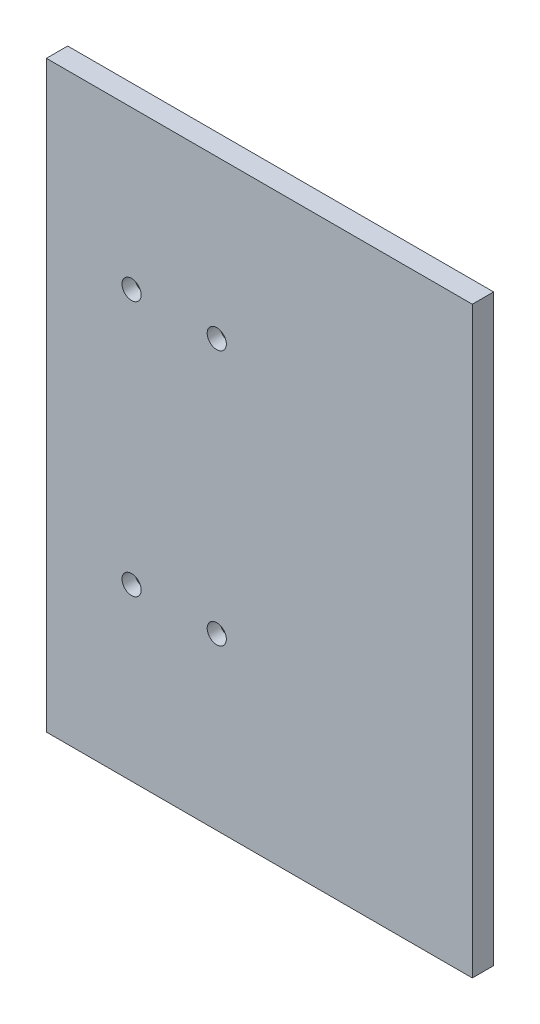
ISO-10303-21;
HEADER;
FILE_DESCRIPTION(('STEP AP214'),'2;1');
FILE_NAME('part.step','',(''),(''),'','','');
FILE_SCHEMA(('AUTOMOTIVE_DESIGN { 1 0 10303 214 1 1 1 1 }'));
ENDSEC;
DATA;
#1=APPLICATION_CONTEXT('core data for automotive mechanical design processes');
#2=APPLICATION_PROTOCOL_DEFINITION('international standard','automotive_design',2000,#1);
#3=PRODUCT_CONTEXT('',#1,'mechanical');
#4=PRODUCT('Part','Part','',(#3));
#5=PRODUCT_RELATED_PRODUCT_CATEGORY('part','',(#4));
#6=PRODUCT_DEFINITION_FORMATION('','',#4);
#7=PRODUCT_DEFINITION_CONTEXT('part definition',#1,'design');
#8=PRODUCT_DEFINITION('design','',#6,#7);
#9=PRODUCT_DEFINITION_SHAPE('','',#8);
#10=(LENGTH_UNIT() NAMED_UNIT(*) SI_UNIT(.MILLI.,.METRE.));
#11=(NAMED_UNIT(*) PLANE_ANGLE_UNIT() SI_UNIT($,.RADIAN.));
#12=(NAMED_UNIT(*) SI_UNIT($,.STERADIAN.) SOLID_ANGLE_UNIT());
#13=UNCERTAINTY_MEASURE_WITH_UNIT(LENGTH_MEASURE(1.E-05),#10,'distance_accuracy_value','');
#14=(GEOMETRIC_REPRESENTATION_CONTEXT(3) GLOBAL_UNCERTAINTY_ASSIGNED_CONTEXT((#13)) GLOBAL_UNIT_ASSIGNED_CONTEXT((#10,
#11,#12)) REPRESENTATION_CONTEXT('',''));
#15=CARTESIAN_POINT('',(0.,0.,0.));
#16=DIRECTION('',(0.,0.,1.));
#17=DIRECTION('',(1.,0.,0.));
#18=AXIS2_PLACEMENT_3D('',#15,#16,#17);
#19=CARTESIAN_POINT('',(-63.5,173.99,6.35));
#20=DIRECTION('',(1.,0.,0.));
#21=DIRECTION('',(0.,0.,-1.));
#22=AXIS2_PLACEMENT_3D('',#19,#20,#21);
#23=PLANE('',#22);
#24=DIRECTION('',(0.,-1.,0.));
#25=VECTOR('',#24,1.);
#26=CARTESIAN_POINT('',(-63.5,173.99,0.));
#27=LINE('',#26,#25);
#28=CARTESIAN_POINT('',(-63.5,173.99,0.));
#29=VERTEX_POINT('',#28);
#30=CARTESIAN_POINT('',(-63.5,0.,0.));
#31=VERTEX_POINT('',#30);
#32=EDGE_CURVE('E95',#29,#31,#27,.T.);
#33=ORIENTED_EDGE('',*,*,#32,.T.);
#34=DIRECTION('',(0.,0.,-1.));
#35=VECTOR('',#34,1.);
#36=CARTESIAN_POINT('',(-63.5,0.,6.35));
#37=LINE('',#36,#35);
#38=CARTESIAN_POINT('',(-63.5,0.,6.35));
#39=VERTEX_POINT('',#38);
#40=EDGE_CURVE('E48',#39,#31,#37,.T.);
#41=ORIENTED_EDGE('',*,*,#40,.F.);
#42=DIRECTION('',(0.,-1.,0.));
#43=VECTOR('',#42,1.);
#44=CARTESIAN_POINT('',(-63.5,173.99,6.35));
#45=LINE('',#44,#43);
#46=CARTESIAN_POINT('',(-63.5,173.99,6.35));
#47=VERTEX_POINT('',#46);
#48=EDGE_CURVE('E87',#47,#39,#45,.T.);
#49=ORIENTED_EDGE('',*,*,#48,.F.);
#50=DIRECTION('',(0.,0.,-1.));
#51=VECTOR('',#50,1.);
#52=CARTESIAN_POINT('',(-63.5,173.99,6.35));
#53=LINE('',#52,#51);
#54=EDGE_CURVE('E11',#47,#29,#53,.T.);
#55=ORIENTED_EDGE('',*,*,#54,.T.);
#56=EDGE_LOOP('',(#33,#41,#49,#55));
#57=FACE_BOUND('',#56,.T.);
#58=ADVANCED_FACE('F39',(#57),#23,.F.);
#59=CARTESIAN_POINT('',(63.5,0.,6.35));
#60=DIRECTION('',(0.,1.,0.));
#61=DIRECTION('',(-1.,0.,0.));
#62=AXIS2_PLACEMENT_3D('',#59,#60,#61);
#63=PLANE('',#62);
#64=DIRECTION('',(1.,0.,0.));
#65=VECTOR('',#64,1.);
#66=CARTESIAN_POINT('',(63.5,0.,0.));
#67=LINE('',#66,#65);
#68=CARTESIAN_POINT('',(63.5,0.,0.));
#69=VERTEX_POINT('',#68);
#70=EDGE_CURVE('E74',#31,#69,#67,.T.);
#71=ORIENTED_EDGE('',*,*,#70,.T.);
#72=DIRECTION('',(0.,0.,-1.));
#73=VECTOR('',#72,1.);
#74=CARTESIAN_POINT('',(63.5,0.,6.35));
#75=LINE('',#74,#73);
#76=CARTESIAN_POINT('',(63.5,0.,6.35));
#77=VERTEX_POINT('',#76);
#78=EDGE_CURVE('E97',#77,#69,#75,.T.);
#79=ORIENTED_EDGE('',*,*,#78,.F.);
#80=DIRECTION('',(1.,0.,0.));
#81=VECTOR('',#80,1.);
#82=CARTESIAN_POINT('',(63.5,0.,6.35));
#83=LINE('',#82,#81);
#84=EDGE_CURVE('E91',#39,#77,#83,.T.);
#85=ORIENTED_EDGE('',*,*,#84,.F.);
#86=ORIENTED_EDGE('',*,*,#40,.T.);
#87=EDGE_LOOP('',(#71,#79,#85,#86));
#88=FACE_BOUND('',#87,.T.);
#89=ADVANCED_FACE('F98',(#88),#63,.F.);
#90=CARTESIAN_POINT('',(63.5,173.99,6.35));
#91=DIRECTION('',(-1.,0.,0.));
#92=DIRECTION('',(0.,0.,1.));
#93=AXIS2_PLACEMENT_3D('',#90,#91,#92);
#94=PLANE('',#93);
#95=DIRECTION('',(0.,1.,0.));
#96=VECTOR('',#95,1.);
#97=CARTESIAN_POINT('',(63.5,173.99,0.));
#98=LINE('',#97,#96);
#99=CARTESIAN_POINT('',(63.5,173.99,0.));
#100=VERTEX_POINT('',#99);
#101=EDGE_CURVE('E81',#69,#100,#98,.T.);
#102=ORIENTED_EDGE('',*,*,#101,.T.);
#103=DIRECTION('',(0.,0.,-1.));
#104=VECTOR('',#103,1.);
#105=CARTESIAN_POINT('',(63.5,173.99,6.35));
#106=LINE('',#105,#104);
#107=CARTESIAN_POINT('',(63.5,173.99,6.35));
#108=VERTEX_POINT('',#107);
#109=EDGE_CURVE('E104',#108,#100,#106,.T.);
#110=ORIENTED_EDGE('',*,*,#109,.F.);
#111=DIRECTION('',(0.,1.,0.));
#112=VECTOR('',#111,1.);
#113=CARTESIAN_POINT('',(63.5,173.99,6.35));
#114=LINE('',#113,#112);
#115=EDGE_CURVE('E101',#77,#108,#114,.T.);
#116=ORIENTED_EDGE('',*,*,#115,.F.);
#117=ORIENTED_EDGE('',*,*,#78,.T.);
#118=EDGE_LOOP('',(#102,#110,#116,#117));
#119=FACE_BOUND('',#118,.T.);
#120=ADVANCED_FACE('F121',(#119),#94,.F.);
#121=CARTESIAN_POINT('',(0.,173.99,6.35));
#122=DIRECTION('',(0.,-1.,0.));
#123=DIRECTION('',(0.,0.,-1.));
#124=AXIS2_PLACEMENT_3D('',#121,#122,#123);
#125=PLANE('',#124);
#126=DIRECTION('',(-1.,0.,0.));
#127=VECTOR('',#126,1.);
#128=CARTESIAN_POINT('',(0.,173.99,0.));
#129=LINE('',#128,#127);
#130=EDGE_CURVE('E115',#100,#29,#129,.T.);
#131=ORIENTED_EDGE('',*,*,#130,.T.);
#132=ORIENTED_EDGE('',*,*,#54,.F.);
#133=DIRECTION('',(-1.,0.,0.));
#134=VECTOR('',#133,1.);
#135=CARTESIAN_POINT('',(0.,173.99,6.35));
#136=LINE('',#135,#134);
#137=EDGE_CURVE('E56',#108,#47,#136,.T.);
#138=ORIENTED_EDGE('',*,*,#137,.F.);
#139=ORIENTED_EDGE('',*,*,#109,.T.);
#140=EDGE_LOOP('',(#131,#132,#138,#139));
#141=FACE_BOUND('',#140,.T.);
#142=ADVANCED_FACE('F125',(#141),#125,.F.);
#143=CARTESIAN_POINT('',(0.,0.,6.35));
#144=DIRECTION('',(0.,0.,1.));
#145=DIRECTION('',(1.,0.,0.));
#146=AXIS2_PLACEMENT_3D('',#143,#144,#145);
#147=PLANE('',#146);
#148=CARTESIAN_POINT('',(-38.1,50.8,6.35));
#149=DIRECTION('',(0.,0.,1.));
#150=DIRECTION('',(1.,0.,0.));
#151=AXIS2_PLACEMENT_3D('',#148,#149,#150);
#152=CIRCLE('',#151,2.8575);
#153=CARTESIAN_POINT('',(-35.2425,50.8,6.35));
#154=VERTEX_POINT('',#153);
#155=EDGE_CURVE('E368',#154,#154,#152,.T.);
#156=ORIENTED_EDGE('',*,*,#155,.F.);
#157=EDGE_LOOP('',(#156));
#158=FACE_BOUND('',#157,.T.);
#159=CARTESIAN_POINT('',(-12.7,50.8,6.35));
#160=DIRECTION('',(0.,0.,1.));
#161=DIRECTION('',(1.,0.,0.));
#162=AXIS2_PLACEMENT_3D('',#159,#160,#161);
#163=CIRCLE('',#162,2.8575);
#164=CARTESIAN_POINT('',(-9.8425,50.8,6.35));
#165=VERTEX_POINT('',#164);
#166=EDGE_CURVE('E360',#165,#165,#163,.T.);
#167=ORIENTED_EDGE('',*,*,#166,.F.);
#168=EDGE_LOOP('',(#167));
#169=FACE_BOUND('',#168,.T.);
#170=CARTESIAN_POINT('',(-12.7,127.,6.35));
#171=DIRECTION('',(0.,0.,1.));
#172=DIRECTION('',(1.,0.,0.));
#173=AXIS2_PLACEMENT_3D('',#170,#171,#172);
#174=CIRCLE('',#173,2.8575);
#175=CARTESIAN_POINT('',(-9.8425,127.,6.35));
#176=VERTEX_POINT('',#175);
#177=EDGE_CURVE('E351',#176,#176,#174,.T.);
#178=ORIENTED_EDGE('',*,*,#177,.F.);
#179=EDGE_LOOP('',(#178));
#180=FACE_BOUND('',#179,.T.);
#181=CARTESIAN_POINT('',(-38.1,127.,6.35));
#182=DIRECTION('',(0.,0.,1.));
#183=DIRECTION('',(1.,0.,0.));
#184=AXIS2_PLACEMENT_3D('',#181,#182,#183);
#185=CIRCLE('',#184,2.8575);
#186=CARTESIAN_POINT('',(-35.2425,127.,6.35));
#187=VERTEX_POINT('',#186);
#188=EDGE_CURVE('E355',#187,#187,#185,.T.);
#189=ORIENTED_EDGE('',*,*,#188,.F.);
#190=EDGE_LOOP('',(#189));
#191=FACE_BOUND('',#190,.T.);
#192=ORIENTED_EDGE('',*,*,#137,.T.);
#193=ORIENTED_EDGE('',*,*,#48,.T.);
#194=ORIENTED_EDGE('',*,*,#84,.T.);
#195=ORIENTED_EDGE('',*,*,#115,.T.);
#196=EDGE_LOOP('',(#192,#193,#194,#195));
#197=FACE_BOUND('',#196,.T.);
#198=ADVANCED_FACE('F89',(#158,#169,#180,#191,#197),#147,.T.);
#199=CARTESIAN_POINT('',(0.,0.,0.));
#200=DIRECTION('',(0.,0.,1.));
#201=DIRECTION('',(1.,0.,0.));
#202=AXIS2_PLACEMENT_3D('',#199,#200,#201);
#203=PLANE('',#202);
#204=CARTESIAN_POINT('',(43.0645431175458,51.4702652625299,0.));
#205=DIRECTION('',(0.,0.,-1.));
#206=DIRECTION('',(-1.,0.,0.));
#207=AXIS2_PLACEMENT_3D('',#204,#205,#206);
#208=CIRCLE('',#207,2.8575);
#209=CARTESIAN_POINT('',(40.2070431175458,51.4702652625299,0.));
#210=VERTEX_POINT('',#209);
#211=EDGE_CURVE('E333',#210,#210,#208,.T.);
#212=ORIENTED_EDGE('',*,*,#211,.F.);
#213=EDGE_LOOP('',(#212));
#214=FACE_BOUND('',#213,.T.);
#215=CARTESIAN_POINT('',(3.69454311754585,51.4702652625299,0.));
#216=DIRECTION('',(0.,0.,-1.));
#217=DIRECTION('',(-1.,0.,0.));
#218=AXIS2_PLACEMENT_3D('',#215,#216,#217);
#219=CIRCLE('',#218,2.8575);
#220=CARTESIAN_POINT('',(0.837043117545849,51.4702652625299,0.));
#221=VERTEX_POINT('',#220);
#222=EDGE_CURVE('E388',#221,#221,#219,.T.);
#223=ORIENTED_EDGE('',*,*,#222,.F.);
#224=EDGE_LOOP('',(#223));
#225=FACE_BOUND('',#224,.T.);
#226=CARTESIAN_POINT('',(3.69454311754585,133.51026526253,0.));
#227=DIRECTION('',(0.,0.,-1.));
#228=DIRECTION('',(-1.,0.,0.));
#229=AXIS2_PLACEMENT_3D('',#226,#227,#228);
#230=CIRCLE('',#229,2.8575);
#231=CARTESIAN_POINT('',(0.837043117545849,133.51026526253,0.));
#232=VERTEX_POINT('',#231);
#233=EDGE_CURVE('E350',#232,#232,#230,.T.);
#234=ORIENTED_EDGE('',*,*,#233,.F.);
#235=EDGE_LOOP('',(#234));
#236=FACE_BOUND('',#235,.T.);
#237=CARTESIAN_POINT('',(43.0645431175458,133.51026526253,0.));
#238=DIRECTION('',(0.,0.,-1.));
#239=DIRECTION('',(-1.,0.,0.));
#240=AXIS2_PLACEMENT_3D('',#237,#238,#239);
#241=CIRCLE('',#240,2.8575);
#242=CARTESIAN_POINT('',(40.2070431175458,133.51026526253,0.));
#243=VERTEX_POINT('',#242);
#244=EDGE_CURVE('E346',#243,#243,#241,.T.);
#245=ORIENTED_EDGE('',*,*,#244,.F.);
#246=EDGE_LOOP('',(#245));
#247=FACE_BOUND('',#246,.T.);
#248=ORIENTED_EDGE('',*,*,#32,.F.);
#249=ORIENTED_EDGE('',*,*,#130,.F.);
#250=ORIENTED_EDGE('',*,*,#101,.F.);
#251=ORIENTED_EDGE('',*,*,#70,.F.);
#252=EDGE_LOOP('',(#248,#249,#250,#251));
#253=FACE_BOUND('',#252,.T.);
#254=ADVANCED_FACE('F124',(#214,#225,#236,#247,#253),#203,.F.);
#255=CARTESIAN_POINT('',(-38.1,127.,2.54));
#256=DIRECTION('',(0.,0.,1.));
#257=DIRECTION('',(1.,0.,0.));
#258=AXIS2_PLACEMENT_3D('',#255,#256,#257);
#259=CYLINDRICAL_SURFACE('',#258,2.8575);
#260=CARTESIAN_POINT('',(-38.1,127.,2.54));
#261=DIRECTION('',(0.,0.,1.));
#262=DIRECTION('',(1.,0.,0.));
#263=AXIS2_PLACEMENT_3D('',#260,#261,#262);
#264=CIRCLE('',#263,2.8575);
#265=CARTESIAN_POINT('',(-35.2425,127.,2.54));
#266=VERTEX_POINT('',#265);
#267=EDGE_CURVE('E110',#266,#266,#264,.T.);
#268=ORIENTED_EDGE('',*,*,#267,.F.);
#269=EDGE_LOOP('',(#268));
#270=FACE_BOUND('',#269,.T.);
#271=ORIENTED_EDGE('',*,*,#188,.T.);
#272=EDGE_LOOP('',(#271));
#273=FACE_BOUND('',#272,.T.);
#274=ADVANCED_FACE('F164',(#270,#273),#259,.F.);
#275=CARTESIAN_POINT('',(-38.1,127.,2.54));
#276=DIRECTION('',(0.,0.,1.));
#277=DIRECTION('',(1.,0.,0.));
#278=AXIS2_PLACEMENT_3D('',#275,#276,#277);
#279=PLANE('',#278);
#280=ORIENTED_EDGE('',*,*,#267,.T.);
#281=EDGE_LOOP('',(#280));
#282=FACE_BOUND('',#281,.T.);
#283=ADVANCED_FACE('F169',(#282),#279,.T.);
#284=CARTESIAN_POINT('',(-12.7,127.,2.54));
#285=DIRECTION('',(0.,0.,1.));
#286=DIRECTION('',(1.,0.,0.));
#287=AXIS2_PLACEMENT_3D('',#284,#285,#286);
#288=CYLINDRICAL_SURFACE('',#287,2.8575);
#289=CARTESIAN_POINT('',(-12.7,127.,2.54));
#290=DIRECTION('',(0.,0.,1.));
#291=DIRECTION('',(1.,0.,0.));
#292=AXIS2_PLACEMENT_3D('',#289,#290,#291);
#293=CIRCLE('',#292,2.8575);
#294=CARTESIAN_POINT('',(-9.8425,127.,2.54));
#295=VERTEX_POINT('',#294);
#296=EDGE_CURVE('E356',#295,#295,#293,.T.);
#297=ORIENTED_EDGE('',*,*,#296,.F.);
#298=EDGE_LOOP('',(#297));
#299=FACE_BOUND('',#298,.T.);
#300=ORIENTED_EDGE('',*,*,#177,.T.);
#301=EDGE_LOOP('',(#300));
#302=FACE_BOUND('',#301,.T.);
#303=ADVANCED_FACE('F179',(#299,#302),#288,.F.);
#304=CARTESIAN_POINT('',(-12.7,127.,2.54));
#305=DIRECTION('',(0.,0.,1.));
#306=DIRECTION('',(1.,0.,0.));
#307=AXIS2_PLACEMENT_3D('',#304,#305,#306);
#308=PLANE('',#307);
#309=ORIENTED_EDGE('',*,*,#296,.T.);
#310=EDGE_LOOP('',(#309));
#311=FACE_BOUND('',#310,.T.);
#312=ADVANCED_FACE('F189',(#311),#308,.T.);
#313=CARTESIAN_POINT('',(-12.7,50.8,2.54));
#314=DIRECTION('',(0.,0.,1.));
#315=DIRECTION('',(1.,0.,0.));
#316=AXIS2_PLACEMENT_3D('',#313,#314,#315);
#317=CYLINDRICAL_SURFACE('',#316,2.8575);
#318=CARTESIAN_POINT('',(-12.7,50.8,2.54));
#319=DIRECTION('',(0.,0.,1.));
#320=DIRECTION('',(1.,0.,0.));
#321=AXIS2_PLACEMENT_3D('',#318,#319,#320);
#322=CIRCLE('',#321,2.8575);
#323=CARTESIAN_POINT('',(-9.8425,50.8,2.54));
#324=VERTEX_POINT('',#323);
#325=EDGE_CURVE('E364',#324,#324,#322,.T.);
#326=ORIENTED_EDGE('',*,*,#325,.F.);
#327=EDGE_LOOP('',(#326));
#328=FACE_BOUND('',#327,.T.);
#329=ORIENTED_EDGE('',*,*,#166,.T.);
#330=EDGE_LOOP('',(#329));
#331=FACE_BOUND('',#330,.T.);
#332=ADVANCED_FACE('F199',(#328,#331),#317,.F.);
#333=CARTESIAN_POINT('',(-12.7,50.8,2.54));
#334=DIRECTION('',(0.,0.,1.));
#335=DIRECTION('',(1.,0.,0.));
#336=AXIS2_PLACEMENT_3D('',#333,#334,#335);
#337=PLANE('',#336);
#338=ORIENTED_EDGE('',*,*,#325,.T.);
#339=EDGE_LOOP('',(#338));
#340=FACE_BOUND('',#339,.T.);
#341=ADVANCED_FACE('F209',(#340),#337,.T.);
#342=CARTESIAN_POINT('',(-38.1,50.8,2.54));
#343=DIRECTION('',(0.,0.,1.));
#344=DIRECTION('',(1.,0.,0.));
#345=AXIS2_PLACEMENT_3D('',#342,#343,#344);
#346=CYLINDRICAL_SURFACE('',#345,2.8575);
#347=CARTESIAN_POINT('',(-38.1,50.8,2.54));
#348=DIRECTION('',(0.,0.,1.));
#349=DIRECTION('',(1.,0.,0.));
#350=AXIS2_PLACEMENT_3D('',#347,#348,#349);
#351=CIRCLE('',#350,2.8575);
#352=CARTESIAN_POINT('',(-35.2425,50.8,2.54));
#353=VERTEX_POINT('',#352);
#354=EDGE_CURVE('E345',#353,#353,#351,.T.);
#355=ORIENTED_EDGE('',*,*,#354,.F.);
#356=EDGE_LOOP('',(#355));
#357=FACE_BOUND('',#356,.T.);
#358=ORIENTED_EDGE('',*,*,#155,.T.);
#359=EDGE_LOOP('',(#358));
#360=FACE_BOUND('',#359,.T.);
#361=ADVANCED_FACE('F219',(#357,#360),#346,.F.);
#362=CARTESIAN_POINT('',(-38.1,50.8,2.54));
#363=DIRECTION('',(0.,0.,1.));
#364=DIRECTION('',(1.,0.,0.));
#365=AXIS2_PLACEMENT_3D('',#362,#363,#364);
#366=PLANE('',#365);
#367=ORIENTED_EDGE('',*,*,#354,.T.);
#368=EDGE_LOOP('',(#367));
#369=FACE_BOUND('',#368,.T.);
#370=ADVANCED_FACE('F229',(#369),#366,.T.);
#371=CARTESIAN_POINT('',(43.0645431175458,133.51026526253,3.81));
#372=DIRECTION('',(0.,0.,-1.));
#373=DIRECTION('',(-1.,0.,0.));
#374=AXIS2_PLACEMENT_3D('',#371,#372,#373);
#375=CYLINDRICAL_SURFACE('',#374,2.8575);
#376=CARTESIAN_POINT('',(43.0645431175458,133.51026526253,3.81));
#377=DIRECTION('',(0.,0.,-1.));
#378=DIRECTION('',(-1.,0.,0.));
#379=AXIS2_PLACEMENT_3D('',#376,#377,#378);
#380=CIRCLE('',#379,2.8575);
#381=CARTESIAN_POINT('',(40.2070431175458,133.51026526253,3.81));
#382=VERTEX_POINT('',#381);
#383=EDGE_CURVE('E341',#382,#382,#380,.T.);
#384=ORIENTED_EDGE('',*,*,#383,.F.);
#385=EDGE_LOOP('',(#384));
#386=FACE_BOUND('',#385,.T.);
#387=ORIENTED_EDGE('',*,*,#244,.T.);
#388=EDGE_LOOP('',(#387));
#389=FACE_BOUND('',#388,.T.);
#390=ADVANCED_FACE('F239',(#386,#389),#375,.F.);
#391=CARTESIAN_POINT('',(43.0645431175458,133.51026526253,3.81));
#392=DIRECTION('',(0.,0.,-1.));
#393=DIRECTION('',(-1.,0.,0.));
#394=AXIS2_PLACEMENT_3D('',#391,#392,#393);
#395=PLANE('',#394);
#396=ORIENTED_EDGE('',*,*,#383,.T.);
#397=EDGE_LOOP('',(#396));
#398=FACE_BOUND('',#397,.T.);
#399=ADVANCED_FACE('F255',(#398),#395,.T.);
#400=CARTESIAN_POINT('',(3.69454311754585,133.51026526253,3.81));
#401=DIRECTION('',(0.,0.,-1.));
#402=DIRECTION('',(-1.,0.,0.));
#403=AXIS2_PLACEMENT_3D('',#400,#401,#402);
#404=CYLINDRICAL_SURFACE('',#403,2.8575);
#405=CARTESIAN_POINT('',(3.69454311754585,133.51026526253,3.81));
#406=DIRECTION('',(0.,0.,-1.));
#407=DIRECTION('',(-1.,0.,0.));
#408=AXIS2_PLACEMENT_3D('',#405,#406,#407);
#409=CIRCLE('',#408,2.8575);
#410=CARTESIAN_POINT('',(0.837043117545849,133.51026526253,3.81));
#411=VERTEX_POINT('',#410);
#412=EDGE_CURVE('E384',#411,#411,#409,.T.);
#413=ORIENTED_EDGE('',*,*,#412,.F.);
#414=EDGE_LOOP('',(#413));
#415=FACE_BOUND('',#414,.T.);
#416=ORIENTED_EDGE('',*,*,#233,.T.);
#417=EDGE_LOOP('',(#416));
#418=FACE_BOUND('',#417,.T.);
#419=ADVANCED_FACE('F265',(#415,#418),#404,.F.);
#420=CARTESIAN_POINT('',(3.69454311754585,133.51026526253,3.81));
#421=DIRECTION('',(0.,0.,-1.));
#422=DIRECTION('',(-1.,0.,0.));
#423=AXIS2_PLACEMENT_3D('',#420,#421,#422);
#424=PLANE('',#423);
#425=ORIENTED_EDGE('',*,*,#412,.T.);
#426=EDGE_LOOP('',(#425));
#427=FACE_BOUND('',#426,.T.);
#428=ADVANCED_FACE('F275',(#427),#424,.T.);
#429=CARTESIAN_POINT('',(3.69454311754585,51.4702652625299,3.81));
#430=DIRECTION('',(0.,0.,-1.));
#431=DIRECTION('',(-1.,0.,0.));
#432=AXIS2_PLACEMENT_3D('',#429,#430,#431);
#433=CYLINDRICAL_SURFACE('',#432,2.8575);
#434=CARTESIAN_POINT('',(3.69454311754585,51.4702652625299,3.81));
#435=DIRECTION('',(0.,0.,-1.));
#436=DIRECTION('',(-1.,0.,0.));
#437=AXIS2_PLACEMENT_3D('',#434,#435,#436);
#438=CIRCLE('',#437,2.8575);
#439=CARTESIAN_POINT('',(0.837043117545849,51.4702652625299,3.81));
#440=VERTEX_POINT('',#439);
#441=EDGE_CURVE('E337',#440,#440,#438,.T.);
#442=ORIENTED_EDGE('',*,*,#441,.F.);
#443=EDGE_LOOP('',(#442));
#444=FACE_BOUND('',#443,.T.);
#445=ORIENTED_EDGE('',*,*,#222,.T.);
#446=EDGE_LOOP('',(#445));
#447=FACE_BOUND('',#446,.T.);
#448=ADVANCED_FACE('F285',(#444,#447),#433,.F.);
#449=CARTESIAN_POINT('',(3.69454311754585,51.4702652625299,3.81));
#450=DIRECTION('',(0.,0.,-1.));
#451=DIRECTION('',(-1.,0.,0.));
#452=AXIS2_PLACEMENT_3D('',#449,#450,#451);
#453=PLANE('',#452);
#454=ORIENTED_EDGE('',*,*,#441,.T.);
#455=EDGE_LOOP('',(#454));
#456=FACE_BOUND('',#455,.T.);
#457=ADVANCED_FACE('F295',(#456),#453,.T.);
#458=CARTESIAN_POINT('',(43.0645431175458,51.4702652625299,3.81));
#459=DIRECTION('',(0.,0.,-1.));
#460=DIRECTION('',(-1.,0.,0.));
#461=AXIS2_PLACEMENT_3D('',#458,#459,#460);
#462=CYLINDRICAL_SURFACE('',#461,2.8575);
#463=CARTESIAN_POINT('',(43.0645431175458,51.4702652625299,3.81));
#464=DIRECTION('',(0.,0.,-1.));
#465=DIRECTION('',(-1.,0.,0.));
#466=AXIS2_PLACEMENT_3D('',#463,#464,#465);
#467=CIRCLE('',#466,2.8575);
#468=CARTESIAN_POINT('',(40.2070431175458,51.4702652625299,3.81));
#469=VERTEX_POINT('',#468);
#470=EDGE_CURVE('E331',#469,#469,#467,.T.);
#471=ORIENTED_EDGE('',*,*,#470,.F.);
#472=EDGE_LOOP('',(#471));
#473=FACE_BOUND('',#472,.T.);
#474=ORIENTED_EDGE('',*,*,#211,.T.);
#475=EDGE_LOOP('',(#474));
#476=FACE_BOUND('',#475,.T.);
#477=ADVANCED_FACE('F305',(#473,#476),#462,.F.);
#478=CARTESIAN_POINT('',(43.0645431175458,51.4702652625299,3.81));
#479=DIRECTION('',(0.,0.,-1.));
#480=DIRECTION('',(-1.,0.,0.));
#481=AXIS2_PLACEMENT_3D('',#478,#479,#480);
#482=PLANE('',#481);
#483=ORIENTED_EDGE('',*,*,#470,.T.);
#484=EDGE_LOOP('',(#483));
#485=FACE_BOUND('',#484,.T.);
#486=ADVANCED_FACE('F315',(#485),#482,.T.);
#487=CLOSED_SHELL('',(#58,#89,#120,#142,#198,#254,#274,#283,#303,#312,#332,#341,#361,#370,#390,
#399,#419,#428,#448,#457,#477,#486));
#488=MANIFOLD_SOLID_BREP('B2',#487);
#489=ADVANCED_BREP_SHAPE_REPRESENTATION('',(#18,#488),#14);
#490=SHAPE_DEFINITION_REPRESENTATION(#9,#489);
ENDSEC;
END-ISO-10303-21;
